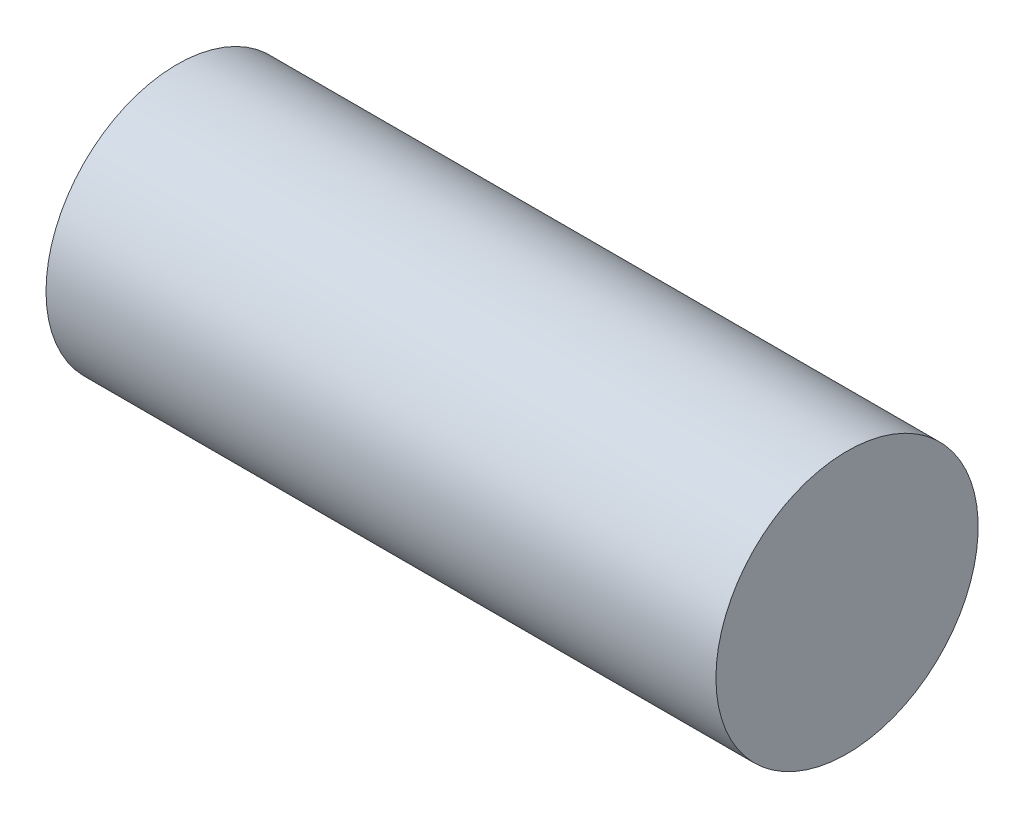
ISO-10303-21;
HEADER;
FILE_DESCRIPTION(('STEP AP214'),'2;1');
FILE_NAME('part.step','',(''),(''),'','','');
FILE_SCHEMA(('AUTOMOTIVE_DESIGN { 1 0 10303 214 1 1 1 1 }'));
ENDSEC;
DATA;
#1=APPLICATION_CONTEXT('core data for automotive mechanical design processes');
#2=APPLICATION_PROTOCOL_DEFINITION('international standard','automotive_design',2000,#1);
#3=PRODUCT_CONTEXT('',#1,'mechanical');
#4=PRODUCT('Part','Part','',(#3));
#5=PRODUCT_RELATED_PRODUCT_CATEGORY('part','',(#4));
#6=PRODUCT_DEFINITION_FORMATION('','',#4);
#7=PRODUCT_DEFINITION_CONTEXT('part definition',#1,'design');
#8=PRODUCT_DEFINITION('design','',#6,#7);
#9=PRODUCT_DEFINITION_SHAPE('','',#8);
#10=(LENGTH_UNIT() NAMED_UNIT(*) SI_UNIT(.MILLI.,.METRE.));
#11=(NAMED_UNIT(*) PLANE_ANGLE_UNIT() SI_UNIT($,.RADIAN.));
#12=(NAMED_UNIT(*) SI_UNIT($,.STERADIAN.) SOLID_ANGLE_UNIT());
#13=UNCERTAINTY_MEASURE_WITH_UNIT(LENGTH_MEASURE(1.E-05),#10,'distance_accuracy_value','');
#14=(GEOMETRIC_REPRESENTATION_CONTEXT(3) GLOBAL_UNCERTAINTY_ASSIGNED_CONTEXT((#13)) GLOBAL_UNIT_ASSIGNED_CONTEXT((#10,
#11,#12)) REPRESENTATION_CONTEXT('',''));
#15=CARTESIAN_POINT('',(0.,0.,0.));
#16=DIRECTION('',(0.,0.,1.));
#17=DIRECTION('',(1.,0.,0.));
#18=AXIS2_PLACEMENT_3D('',#15,#16,#17);
#19=CARTESIAN_POINT('',(88.9,0.,0.));
#20=DIRECTION('',(-1.,0.,0.));
#21=DIRECTION('',(0.,0.,1.));
#22=AXIS2_PLACEMENT_3D('',#19,#20,#21);
#23=PLANE('',#22);
#24=CARTESIAN_POINT('',(88.9,0.,0.));
#25=DIRECTION('',(-1.,0.,0.));
#26=DIRECTION('',(0.,0.,1.));
#27=AXIS2_PLACEMENT_3D('',#24,#25,#26);
#28=CIRCLE('',#27,17.399);
#29=CARTESIAN_POINT('',(88.9,0.,17.399));
#30=VERTEX_POINT('',#29);
#31=EDGE_CURVE('E45',#30,#30,#28,.T.);
#32=ORIENTED_EDGE('',*,*,#31,.F.);
#33=EDGE_LOOP('',(#32));
#34=FACE_BOUND('',#33,.T.);
#35=ADVANCED_FACE('F31',(#34),#23,.F.);
#36=CARTESIAN_POINT('',(76.2,9.525,0.));
#37=DIRECTION('',(1.,0.,0.));
#38=DIRECTION('',(0.,0.,-1.));
#39=AXIS2_PLACEMENT_3D('',#36,#37,#38);
#40=PLANE('',#39);
#41=CARTESIAN_POINT('',(76.2,0.,0.));
#42=DIRECTION('',(-1.,0.,0.));
#43=DIRECTION('',(0.,0.,1.));
#44=AXIS2_PLACEMENT_3D('',#41,#42,#43);
#45=CIRCLE('',#44,9.525);
#46=CARTESIAN_POINT('',(76.2,0.,9.525));
#47=VERTEX_POINT('',#46);
#48=EDGE_CURVE('E10',#47,#47,#45,.T.);
#49=ORIENTED_EDGE('',*,*,#48,.T.);
#50=EDGE_LOOP('',(#49));
#51=FACE_BOUND('',#50,.T.);
#52=ADVANCED_FACE('F54',(#51),#40,.F.);
#53=CARTESIAN_POINT('',(-44.0713905316679,0.,0.));
#54=DIRECTION('',(-1.,0.,0.));
#55=DIRECTION('',(0.,0.,1.));
#56=AXIS2_PLACEMENT_3D('',#53,#54,#55);
#57=CYLINDRICAL_SURFACE('',#56,9.525);
#58=ORIENTED_EDGE('',*,*,#48,.F.);
#59=EDGE_LOOP('',(#58));
#60=FACE_BOUND('',#59,.T.);
#61=CARTESIAN_POINT('',(0.,0.,0.));
#62=DIRECTION('',(-1.,0.,0.));
#63=DIRECTION('',(0.,0.,1.));
#64=AXIS2_PLACEMENT_3D('',#61,#62,#63);
#65=CIRCLE('',#64,9.525);
#66=CARTESIAN_POINT('',(0.,0.,9.525));
#67=VERTEX_POINT('',#66);
#68=EDGE_CURVE('E37',#67,#67,#65,.T.);
#69=ORIENTED_EDGE('',*,*,#68,.T.);
#70=EDGE_LOOP('',(#69));
#71=FACE_BOUND('',#70,.T.);
#72=ADVANCED_FACE('F58',(#60,#71),#57,.F.);
#73=CARTESIAN_POINT('',(0.,9.525,0.));
#74=DIRECTION('',(1.,0.,0.));
#75=DIRECTION('',(0.,0.,-1.));
#76=AXIS2_PLACEMENT_3D('',#73,#74,#75);
#77=PLANE('',#76);
#78=ORIENTED_EDGE('',*,*,#68,.F.);
#79=EDGE_LOOP('',(#78));
#80=FACE_BOUND('',#79,.T.);
#81=CARTESIAN_POINT('',(0.,0.,0.));
#82=DIRECTION('',(-1.,0.,0.));
#83=DIRECTION('',(0.,0.,1.));
#84=AXIS2_PLACEMENT_3D('',#81,#82,#83);
#85=CIRCLE('',#84,17.399);
#86=CARTESIAN_POINT('',(0.,0.,17.399));
#87=VERTEX_POINT('',#86);
#88=EDGE_CURVE('E41',#87,#87,#85,.T.);
#89=ORIENTED_EDGE('',*,*,#88,.T.);
#90=EDGE_LOOP('',(#89));
#91=FACE_BOUND('',#90,.T.);
#92=ADVANCED_FACE('F62',(#80,#91),#77,.F.);
#93=CARTESIAN_POINT('',(-44.0713905316679,0.,0.));
#94=DIRECTION('',(-1.,0.,0.));
#95=DIRECTION('',(0.,0.,1.));
#96=AXIS2_PLACEMENT_3D('',#93,#94,#95);
#97=CYLINDRICAL_SURFACE('',#96,17.399);
#98=ORIENTED_EDGE('',*,*,#88,.F.);
#99=EDGE_LOOP('',(#98));
#100=FACE_BOUND('',#99,.T.);
#101=ORIENTED_EDGE('',*,*,#31,.T.);
#102=EDGE_LOOP('',(#101));
#103=FACE_BOUND('',#102,.T.);
#104=ADVANCED_FACE('F51',(#100,#103),#97,.T.);
#105=CLOSED_SHELL('',(#35,#52,#72,#92,#104));
#106=MANIFOLD_SOLID_BREP('B2',#105);
#107=ADVANCED_BREP_SHAPE_REPRESENTATION('',(#18,#106),#14);
#108=SHAPE_DEFINITION_REPRESENTATION(#9,#107);
ENDSEC;
END-ISO-10303-21;
